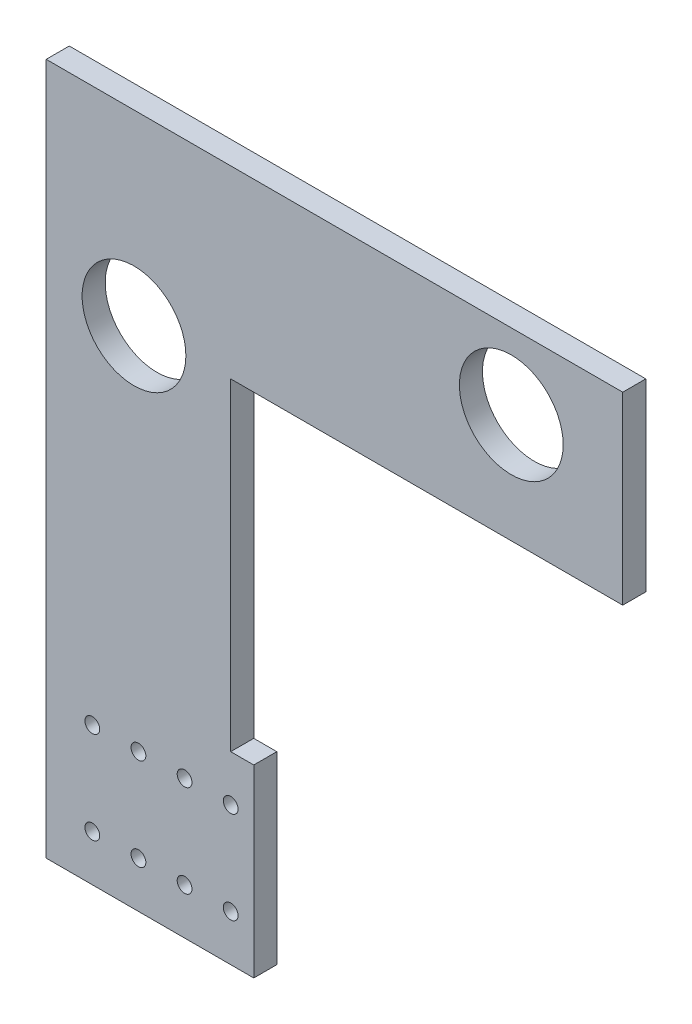
ISO-10303-21;
HEADER;
FILE_DESCRIPTION(('STEP AP214'),'2;1');
FILE_NAME('part.step','',(''),(''),'','','');
FILE_SCHEMA(('AUTOMOTIVE_DESIGN { 1 0 10303 214 1 1 1 1 }'));
ENDSEC;
DATA;
#1=APPLICATION_CONTEXT('core data for automotive mechanical design processes');
#2=APPLICATION_PROTOCOL_DEFINITION('international standard','automotive_design',2000,#1);
#3=PRODUCT_CONTEXT('',#1,'mechanical');
#4=PRODUCT('Part','Part','',(#3));
#5=PRODUCT_RELATED_PRODUCT_CATEGORY('part','',(#4));
#6=PRODUCT_DEFINITION_FORMATION('','',#4);
#7=PRODUCT_DEFINITION_CONTEXT('part definition',#1,'design');
#8=PRODUCT_DEFINITION('design','',#6,#7);
#9=PRODUCT_DEFINITION_SHAPE('','',#8);
#10=(LENGTH_UNIT() NAMED_UNIT(*) SI_UNIT(.MILLI.,.METRE.));
#11=(NAMED_UNIT(*) PLANE_ANGLE_UNIT() SI_UNIT($,.RADIAN.));
#12=(NAMED_UNIT(*) SI_UNIT($,.STERADIAN.) SOLID_ANGLE_UNIT());
#13=UNCERTAINTY_MEASURE_WITH_UNIT(LENGTH_MEASURE(1.E-05),#10,'distance_accuracy_value','');
#14=(GEOMETRIC_REPRESENTATION_CONTEXT(3) GLOBAL_UNCERTAINTY_ASSIGNED_CONTEXT((#13)) GLOBAL_UNIT_ASSIGNED_CONTEXT((#10,
#11,#12)) REPRESENTATION_CONTEXT('',''));
#15=CARTESIAN_POINT('',(0.,0.,0.));
#16=DIRECTION('',(0.,0.,1.));
#17=DIRECTION('',(1.,0.,0.));
#18=AXIS2_PLACEMENT_3D('',#15,#16,#17);
#19=CARTESIAN_POINT('',(-74.9920312203596,-159.641560720638,6.35));
#20=DIRECTION('',(0.,1.,0.));
#21=DIRECTION('',(0.,0.,1.));
#22=AXIS2_PLACEMENT_3D('',#19,#20,#21);
#23=PLANE('',#22);
#24=DIRECTION('',(1.,0.,0.));
#25=VECTOR('',#24,1.);
#26=CARTESIAN_POINT('',(-74.9920312203596,-159.641560720638,0.));
#27=LINE('',#26,#25);
#28=CARTESIAN_POINT('',(-125.79203122036,-159.641560720638,0.));
#29=VERTEX_POINT('',#28);
#30=CARTESIAN_POINT('',(-68.6420312203597,-159.641560720638,0.));
#31=VERTEX_POINT('',#30);
#32=EDGE_CURVE('E134',#29,#31,#27,.T.);
#33=ORIENTED_EDGE('',*,*,#32,.T.);
#34=DIRECTION('',(0.,0.,-1.));
#35=VECTOR('',#34,1.);
#36=CARTESIAN_POINT('',(-68.6420312203597,-159.641560720638,6.35));
#37=LINE('',#36,#35);
#38=CARTESIAN_POINT('',(-68.6420312203597,-159.641560720638,6.35));
#39=VERTEX_POINT('',#38);
#40=EDGE_CURVE('E42',#39,#31,#37,.T.);
#41=ORIENTED_EDGE('',*,*,#40,.F.);
#42=DIRECTION('',(1.,0.,0.));
#43=VECTOR('',#42,1.);
#44=CARTESIAN_POINT('',(-125.79203122036,-159.641560720638,6.35));
#45=LINE('',#44,#43);
#46=CARTESIAN_POINT('',(-125.79203122036,-159.641560720638,6.35));
#47=VERTEX_POINT('',#46);
#48=EDGE_CURVE('E94',#47,#39,#45,.T.);
#49=ORIENTED_EDGE('',*,*,#48,.F.);
#50=DIRECTION('',(0.,0.,-1.));
#51=VECTOR('',#50,1.);
#52=CARTESIAN_POINT('',(-125.79203122036,-159.641560720638,6.35));
#53=LINE('',#52,#51);
#54=EDGE_CURVE('E11',#47,#29,#53,.T.);
#55=ORIENTED_EDGE('',*,*,#54,.T.);
#56=EDGE_LOOP('',(#33,#41,#49,#55));
#57=FACE_BOUND('',#56,.T.);
#58=ADVANCED_FACE('F34',(#57),#23,.F.);
#59=CARTESIAN_POINT('',(-68.6420312203597,-159.641560720638,6.35));
#60=DIRECTION('',(-1.,0.,0.));
#61=DIRECTION('',(0.,0.,1.));
#62=AXIS2_PLACEMENT_3D('',#59,#60,#61);
#63=PLANE('',#62);
#64=DIRECTION('',(0.,1.,0.));
#65=VECTOR('',#64,1.);
#66=CARTESIAN_POINT('',(-68.6420312203597,-159.641560720638,0.));
#67=LINE('',#66,#65);
#68=CARTESIAN_POINT('',(-68.6420312203597,-108.841560720638,0.));
#69=VERTEX_POINT('',#68);
#70=EDGE_CURVE('E136',#31,#69,#67,.T.);
#71=ORIENTED_EDGE('',*,*,#70,.T.);
#72=DIRECTION('',(0.,0.,-1.));
#73=VECTOR('',#72,1.);
#74=CARTESIAN_POINT('',(-68.6420312203597,-108.841560720638,6.35));
#75=LINE('',#74,#73);
#76=CARTESIAN_POINT('',(-68.6420312203597,-108.841560720638,6.35));
#77=VERTEX_POINT('',#76);
#78=EDGE_CURVE('E155',#77,#69,#75,.T.);
#79=ORIENTED_EDGE('',*,*,#78,.F.);
#80=DIRECTION('',(0.,1.,0.));
#81=VECTOR('',#80,1.);
#82=CARTESIAN_POINT('',(-68.6420312203597,-159.641560720638,6.35));
#83=LINE('',#82,#81);
#84=EDGE_CURVE('E163',#39,#77,#83,.T.);
#85=ORIENTED_EDGE('',*,*,#84,.F.);
#86=ORIENTED_EDGE('',*,*,#40,.T.);
#87=EDGE_LOOP('',(#71,#79,#85,#86));
#88=FACE_BOUND('',#87,.T.);
#89=ADVANCED_FACE('F161',(#88),#63,.F.);
#90=CARTESIAN_POINT('',(-68.6420312203597,-108.841560720638,6.35));
#91=DIRECTION('',(0.,-1.,0.));
#92=DIRECTION('',(0.,0.,-1.));
#93=AXIS2_PLACEMENT_3D('',#90,#91,#92);
#94=PLANE('',#93);
#95=DIRECTION('',(-1.,0.,0.));
#96=VECTOR('',#95,1.);
#97=CARTESIAN_POINT('',(-68.6420312203597,-108.841560720638,0.));
#98=LINE('',#97,#96);
#99=CARTESIAN_POINT('',(-74.9920312203596,-108.841560720638,0.));
#100=VERTEX_POINT('',#99);
#101=EDGE_CURVE('E139',#69,#100,#98,.T.);
#102=ORIENTED_EDGE('',*,*,#101,.T.);
#103=DIRECTION('',(0.,0.,-1.));
#104=VECTOR('',#103,1.);
#105=CARTESIAN_POINT('',(-74.9920312203596,-108.841560720638,6.35));
#106=LINE('',#105,#104);
#107=CARTESIAN_POINT('',(-74.9920312203596,-108.841560720638,6.35));
#108=VERTEX_POINT('',#107);
#109=EDGE_CURVE('E152',#108,#100,#106,.T.);
#110=ORIENTED_EDGE('',*,*,#109,.F.);
#111=DIRECTION('',(-1.,0.,0.));
#112=VECTOR('',#111,1.);
#113=CARTESIAN_POINT('',(-68.6420312203597,-108.841560720638,6.35));
#114=LINE('',#113,#112);
#115=EDGE_CURVE('E175',#77,#108,#114,.T.);
#116=ORIENTED_EDGE('',*,*,#115,.F.);
#117=ORIENTED_EDGE('',*,*,#78,.T.);
#118=EDGE_LOOP('',(#102,#110,#116,#117));
#119=FACE_BOUND('',#118,.T.);
#120=ADVANCED_FACE('F171',(#119),#94,.F.);
#121=CARTESIAN_POINT('',(-74.9920312203596,-19.9415607206385,6.35));
#122=DIRECTION('',(-1.,0.,0.));
#123=DIRECTION('',(0.,0.,1.));
#124=AXIS2_PLACEMENT_3D('',#121,#122,#123);
#125=PLANE('',#124);
#126=DIRECTION('',(0.,1.,0.));
#127=VECTOR('',#126,1.);
#128=CARTESIAN_POINT('',(-74.9920312203596,-19.9415607206385,0.));
#129=LINE('',#128,#127);
#130=CARTESIAN_POINT('',(-74.9920312203596,-19.9415607206385,0.));
#131=VERTEX_POINT('',#130);
#132=EDGE_CURVE('E141',#100,#131,#129,.T.);
#133=ORIENTED_EDGE('',*,*,#132,.T.);
#134=DIRECTION('',(0.,0.,-1.));
#135=VECTOR('',#134,1.);
#136=CARTESIAN_POINT('',(-74.9920312203596,-19.9415607206385,6.35));
#137=LINE('',#136,#135);
#138=CARTESIAN_POINT('',(-74.9920312203596,-19.9415607206385,6.35));
#139=VERTEX_POINT('',#138);
#140=EDGE_CURVE('E123',#139,#131,#137,.T.);
#141=ORIENTED_EDGE('',*,*,#140,.F.);
#142=DIRECTION('',(0.,1.,0.));
#143=VECTOR('',#142,1.);
#144=CARTESIAN_POINT('',(-74.9920312203596,-19.9415607206385,6.35));
#145=LINE('',#144,#143);
#146=EDGE_CURVE('E114',#108,#139,#145,.T.);
#147=ORIENTED_EDGE('',*,*,#146,.F.);
#148=ORIENTED_EDGE('',*,*,#109,.T.);
#149=EDGE_LOOP('',(#133,#141,#147,#148));
#150=FACE_BOUND('',#149,.T.);
#151=ADVANCED_FACE('F174',(#150),#125,.F.);
#152=CARTESIAN_POINT('',(-74.9920312203596,-19.9415607206385,6.35));
#153=DIRECTION('',(0.,1.,0.));
#154=DIRECTION('',(0.,0.,1.));
#155=AXIS2_PLACEMENT_3D('',#152,#153,#154);
#156=PLANE('',#155);
#157=DIRECTION('',(1.,0.,0.));
#158=VECTOR('',#157,1.);
#159=CARTESIAN_POINT('',(-74.9920312203596,-19.9415607206385,0.));
#160=LINE('',#159,#158);
#161=CARTESIAN_POINT('',(32.9579687796403,-19.9415607206385,0.));
#162=VERTEX_POINT('',#161);
#163=EDGE_CURVE('E122',#131,#162,#160,.T.);
#164=ORIENTED_EDGE('',*,*,#163,.T.);
#165=DIRECTION('',(0.,0.,-1.));
#166=VECTOR('',#165,1.);
#167=CARTESIAN_POINT('',(32.9579687796403,-19.9415607206385,6.35));
#168=LINE('',#167,#166);
#169=CARTESIAN_POINT('',(32.9579687796403,-19.9415607206385,6.35));
#170=VERTEX_POINT('',#169);
#171=EDGE_CURVE('E119',#170,#162,#168,.T.);
#172=ORIENTED_EDGE('',*,*,#171,.F.);
#173=DIRECTION('',(1.,0.,0.));
#174=VECTOR('',#173,1.);
#175=CARTESIAN_POINT('',(-74.9920312203596,-19.9415607206385,6.35));
#176=LINE('',#175,#174);
#177=EDGE_CURVE('E108',#139,#170,#176,.T.);
#178=ORIENTED_EDGE('',*,*,#177,.F.);
#179=ORIENTED_EDGE('',*,*,#140,.T.);
#180=EDGE_LOOP('',(#164,#172,#178,#179));
#181=FACE_BOUND('',#180,.T.);
#182=ADVANCED_FACE('F120',(#181),#156,.F.);
#183=CARTESIAN_POINT('',(32.9579687796403,-19.9415607206385,6.35));
#184=DIRECTION('',(-1.,0.,0.));
#185=DIRECTION('',(0.,0.,1.));
#186=AXIS2_PLACEMENT_3D('',#183,#184,#185);
#187=PLANE('',#186);
#188=DIRECTION('',(0.,1.,0.));
#189=VECTOR('',#188,1.);
#190=CARTESIAN_POINT('',(32.9579687796403,-19.9415607206385,0.));
#191=LINE('',#190,#189);
#192=CARTESIAN_POINT('',(32.9579687796403,30.8584392793615,0.));
#193=VERTEX_POINT('',#192);
#194=EDGE_CURVE('E80',#162,#193,#191,.T.);
#195=ORIENTED_EDGE('',*,*,#194,.T.);
#196=DIRECTION('',(0.,0.,-1.));
#197=VECTOR('',#196,1.);
#198=CARTESIAN_POINT('',(32.9579687796403,30.8584392793615,6.35));
#199=LINE('',#198,#197);
#200=CARTESIAN_POINT('',(32.9579687796403,30.8584392793615,6.35));
#201=VERTEX_POINT('',#200);
#202=EDGE_CURVE('E124',#201,#193,#199,.T.);
#203=ORIENTED_EDGE('',*,*,#202,.F.);
#204=DIRECTION('',(0.,1.,0.));
#205=VECTOR('',#204,1.);
#206=CARTESIAN_POINT('',(32.9579687796403,-19.9415607206385,6.35));
#207=LINE('',#206,#205);
#208=EDGE_CURVE('E112',#170,#201,#207,.T.);
#209=ORIENTED_EDGE('',*,*,#208,.F.);
#210=ORIENTED_EDGE('',*,*,#171,.T.);
#211=EDGE_LOOP('',(#195,#203,#209,#210));
#212=FACE_BOUND('',#211,.T.);
#213=ADVANCED_FACE('F126',(#212),#187,.F.);
#214=CARTESIAN_POINT('',(32.9579687796403,30.8584392793615,6.35));
#215=DIRECTION('',(0.,-1.,0.));
#216=DIRECTION('',(0.,0.,-1.));
#217=AXIS2_PLACEMENT_3D('',#214,#215,#216);
#218=PLANE('',#217);
#219=DIRECTION('',(-1.,0.,0.));
#220=VECTOR('',#219,1.);
#221=CARTESIAN_POINT('',(32.9579687796403,30.8584392793615,0.));
#222=LINE('',#221,#220);
#223=CARTESIAN_POINT('',(-125.79203122036,30.8584392793615,0.));
#224=VERTEX_POINT('',#223);
#225=EDGE_CURVE('E87',#193,#224,#222,.T.);
#226=ORIENTED_EDGE('',*,*,#225,.T.);
#227=DIRECTION('',(0.,0.,-1.));
#228=VECTOR('',#227,1.);
#229=CARTESIAN_POINT('',(-125.79203122036,30.8584392793615,6.35));
#230=LINE('',#229,#228);
#231=CARTESIAN_POINT('',(-125.79203122036,30.8584392793615,6.35));
#232=VERTEX_POINT('',#231);
#233=EDGE_CURVE('E130',#232,#224,#230,.T.);
#234=ORIENTED_EDGE('',*,*,#233,.F.);
#235=DIRECTION('',(-1.,0.,0.));
#236=VECTOR('',#235,1.);
#237=CARTESIAN_POINT('',(32.9579687796403,30.8584392793615,6.35));
#238=LINE('',#237,#236);
#239=EDGE_CURVE('E128',#201,#232,#238,.T.);
#240=ORIENTED_EDGE('',*,*,#239,.F.);
#241=ORIENTED_EDGE('',*,*,#202,.T.);
#242=EDGE_LOOP('',(#226,#234,#240,#241));
#243=FACE_BOUND('',#242,.T.);
#244=ADVANCED_FACE('F272',(#243),#218,.F.);
#245=CARTESIAN_POINT('',(-125.79203122036,30.8584392793615,6.35));
#246=DIRECTION('',(1.,0.,0.));
#247=DIRECTION('',(0.,0.,-1.));
#248=AXIS2_PLACEMENT_3D('',#245,#246,#247);
#249=PLANE('',#248);
#250=DIRECTION('',(0.,-1.,0.));
#251=VECTOR('',#250,1.);
#252=CARTESIAN_POINT('',(-125.79203122036,30.8584392793615,0.));
#253=LINE('',#252,#251);
#254=EDGE_CURVE('E146',#224,#29,#253,.T.);
#255=ORIENTED_EDGE('',*,*,#254,.T.);
#256=ORIENTED_EDGE('',*,*,#54,.F.);
#257=DIRECTION('',(0.,-1.,0.));
#258=VECTOR('',#257,1.);
#259=CARTESIAN_POINT('',(-125.79203122036,-140.591560720638,6.35));
#260=LINE('',#259,#258);
#261=EDGE_CURVE('E50',#232,#47,#260,.T.);
#262=ORIENTED_EDGE('',*,*,#261,.F.);
#263=ORIENTED_EDGE('',*,*,#233,.T.);
#264=EDGE_LOOP('',(#255,#256,#262,#263));
#265=FACE_BOUND('',#264,.T.);
#266=ADVANCED_FACE('F253',(#265),#249,.F.);
#267=CARTESIAN_POINT('',(0.,0.,6.35));
#268=DIRECTION('',(0.,0.,1.));
#269=DIRECTION('',(1.,0.,0.));
#270=AXIS2_PLACEMENT_3D('',#267,#268,#269);
#271=PLANE('',#270);
#272=CARTESIAN_POINT('',(-87.6920312203597,-121.541560720638,6.35));
#273=DIRECTION('',(0.,0.,1.));
#274=DIRECTION('',(1.,0.,0.));
#275=AXIS2_PLACEMENT_3D('',#272,#273,#274);
#276=CIRCLE('',#275,2.03200000000001);
#277=CARTESIAN_POINT('',(-85.6600312203596,-121.541560720638,6.35));
#278=VERTEX_POINT('',#277);
#279=EDGE_CURVE('E218',#278,#278,#276,.T.);
#280=ORIENTED_EDGE('',*,*,#279,.F.);
#281=EDGE_LOOP('',(#280));
#282=FACE_BOUND('',#281,.T.);
#283=CARTESIAN_POINT('',(-113.09203122036,-146.941560720639,6.35));
#284=DIRECTION('',(0.,0.,1.));
#285=DIRECTION('',(1.,0.,0.));
#286=AXIS2_PLACEMENT_3D('',#283,#284,#285);
#287=CIRCLE('',#286,2.032);
#288=CARTESIAN_POINT('',(-111.06003122036,-146.941560720639,6.35));
#289=VERTEX_POINT('',#288);
#290=EDGE_CURVE('E211',#289,#289,#287,.T.);
#291=ORIENTED_EDGE('',*,*,#290,.F.);
#292=EDGE_LOOP('',(#291));
#293=FACE_BOUND('',#292,.T.);
#294=CARTESIAN_POINT('',(-100.39203122036,-146.941560720639,6.35));
#295=DIRECTION('',(0.,0.,1.));
#296=DIRECTION('',(1.,0.,0.));
#297=AXIS2_PLACEMENT_3D('',#294,#295,#296);
#298=CIRCLE('',#297,2.032);
#299=CARTESIAN_POINT('',(-98.3600312203596,-146.941560720639,6.35));
#300=VERTEX_POINT('',#299);
#301=EDGE_CURVE('E230',#300,#300,#298,.T.);
#302=ORIENTED_EDGE('',*,*,#301,.F.);
#303=EDGE_LOOP('',(#302));
#304=FACE_BOUND('',#303,.T.);
#305=CARTESIAN_POINT('',(-74.9920312203596,-121.541560720638,6.35));
#306=DIRECTION('',(0.,0.,1.));
#307=DIRECTION('',(1.,0.,0.));
#308=AXIS2_PLACEMENT_3D('',#305,#306,#307);
#309=CIRCLE('',#308,2.03200000000001);
#310=CARTESIAN_POINT('',(-72.9600312203596,-121.541560720638,6.35));
#311=VERTEX_POINT('',#310);
#312=EDGE_CURVE('E223',#311,#311,#309,.T.);
#313=ORIENTED_EDGE('',*,*,#312,.F.);
#314=EDGE_LOOP('',(#313));
#315=FACE_BOUND('',#314,.T.);
#316=CARTESIAN_POINT('',(-87.6920312203597,-146.941560720639,6.35));
#317=DIRECTION('',(0.,0.,1.));
#318=DIRECTION('',(1.,0.,0.));
#319=AXIS2_PLACEMENT_3D('',#316,#317,#318);
#320=CIRCLE('',#319,2.032);
#321=CARTESIAN_POINT('',(-85.6600312203596,-146.941560720639,6.35));
#322=VERTEX_POINT('',#321);
#323=EDGE_CURVE('E187',#322,#322,#320,.T.);
#324=ORIENTED_EDGE('',*,*,#323,.F.);
#325=EDGE_LOOP('',(#324));
#326=FACE_BOUND('',#325,.T.);
#327=CARTESIAN_POINT('',(-113.09203122036,-121.541560720638,6.35));
#328=DIRECTION('',(0.,0.,1.));
#329=DIRECTION('',(1.,0.,0.));
#330=AXIS2_PLACEMENT_3D('',#327,#328,#329);
#331=CIRCLE('',#330,2.03200000000001);
#332=CARTESIAN_POINT('',(-111.06003122036,-121.541560720638,6.35));
#333=VERTEX_POINT('',#332);
#334=EDGE_CURVE('E194',#333,#333,#331,.T.);
#335=ORIENTED_EDGE('',*,*,#334,.F.);
#336=EDGE_LOOP('',(#335));
#337=FACE_BOUND('',#336,.T.);
#338=CARTESIAN_POINT('',(-74.9920312203596,-146.941560720639,6.35));
#339=DIRECTION('',(0.,0.,1.));
#340=DIRECTION('',(1.,0.,0.));
#341=AXIS2_PLACEMENT_3D('',#338,#339,#340);
#342=CIRCLE('',#341,2.032);
#343=CARTESIAN_POINT('',(-72.9600312203596,-146.941560720639,6.35));
#344=VERTEX_POINT('',#343);
#345=EDGE_CURVE('E200',#344,#344,#342,.T.);
#346=ORIENTED_EDGE('',*,*,#345,.F.);
#347=EDGE_LOOP('',(#346));
#348=FACE_BOUND('',#347,.T.);
#349=CARTESIAN_POINT('',(2.2668849142445,10.1218360725294,6.35));
#350=DIRECTION('',(0.,0.,1.));
#351=DIRECTION('',(1.,0.,0.));
#352=AXIS2_PLACEMENT_3D('',#349,#350,#351);
#353=CIRCLE('',#352,14.2875);
#354=CARTESIAN_POINT('',(16.5543849142445,10.1218360725294,6.35));
#355=VERTEX_POINT('',#354);
#356=EDGE_CURVE('E206',#355,#355,#353,.T.);
#357=ORIENTED_EDGE('',*,*,#356,.F.);
#358=EDGE_LOOP('',(#357));
#359=FACE_BOUND('',#358,.T.);
#360=CARTESIAN_POINT('',(-100.39203122036,-121.541560720638,6.35));
#361=DIRECTION('',(0.,0.,1.));
#362=DIRECTION('',(1.,0.,0.));
#363=AXIS2_PLACEMENT_3D('',#360,#361,#362);
#364=CIRCLE('',#363,2.03200000000001);
#365=CARTESIAN_POINT('',(-98.3600312203596,-121.541560720638,6.35));
#366=VERTEX_POINT('',#365);
#367=EDGE_CURVE('E235',#366,#366,#364,.T.);
#368=ORIENTED_EDGE('',*,*,#367,.F.);
#369=EDGE_LOOP('',(#368));
#370=FACE_BOUND('',#369,.T.);
#371=CARTESIAN_POINT('',(-101.619115085755,-20.6121639274706,6.35));
#372=DIRECTION('',(0.,0.,1.));
#373=DIRECTION('',(1.,0.,0.));
#374=AXIS2_PLACEMENT_3D('',#371,#372,#373);
#375=CIRCLE('',#374,14.2875);
#376=CARTESIAN_POINT('',(-87.3316150857555,-20.6121639274706,6.35));
#377=VERTEX_POINT('',#376);
#378=EDGE_CURVE('E181',#377,#377,#375,.T.);
#379=ORIENTED_EDGE('',*,*,#378,.F.);
#380=EDGE_LOOP('',(#379));
#381=FACE_BOUND('',#380,.T.);
#382=ORIENTED_EDGE('',*,*,#261,.T.);
#383=ORIENTED_EDGE('',*,*,#48,.T.);
#384=ORIENTED_EDGE('',*,*,#84,.T.);
#385=ORIENTED_EDGE('',*,*,#115,.T.);
#386=ORIENTED_EDGE('',*,*,#146,.T.);
#387=ORIENTED_EDGE('',*,*,#177,.T.);
#388=ORIENTED_EDGE('',*,*,#208,.T.);
#389=ORIENTED_EDGE('',*,*,#239,.T.);
#390=EDGE_LOOP('',(#382,#383,#384,#385,#386,#387,#388,#389));
#391=FACE_BOUND('',#390,.T.);
#392=ADVANCED_FACE('F110',(#282,#293,#304,#315,#326,#337,#348,#359,#370,#381,#391),#271,.T.);
#393=CARTESIAN_POINT('',(0.,0.,0.));
#394=DIRECTION('',(0.,0.,1.));
#395=DIRECTION('',(1.,0.,0.));
#396=AXIS2_PLACEMENT_3D('',#393,#394,#395);
#397=PLANE('',#396);
#398=CARTESIAN_POINT('',(-87.6920312203597,-121.541560720638,0.));
#399=DIRECTION('',(0.,0.,1.));
#400=DIRECTION('',(1.,0.,0.));
#401=AXIS2_PLACEMENT_3D('',#398,#399,#400);
#402=CIRCLE('',#401,2.03200000000001);
#403=CARTESIAN_POINT('',(-85.6600312203596,-121.541560720638,0.));
#404=VERTEX_POINT('',#403);
#405=EDGE_CURVE('E191',#404,#404,#402,.T.);
#406=ORIENTED_EDGE('',*,*,#405,.T.);
#407=EDGE_LOOP('',(#406));
#408=FACE_BOUND('',#407,.T.);
#409=CARTESIAN_POINT('',(-113.09203122036,-146.941560720639,0.));
#410=DIRECTION('',(0.,0.,1.));
#411=DIRECTION('',(1.,0.,0.));
#412=AXIS2_PLACEMENT_3D('',#409,#410,#411);
#413=CIRCLE('',#412,2.032);
#414=CARTESIAN_POINT('',(-111.06003122036,-146.941560720639,0.));
#415=VERTEX_POINT('',#414);
#416=EDGE_CURVE('E214',#415,#415,#413,.T.);
#417=ORIENTED_EDGE('',*,*,#416,.T.);
#418=EDGE_LOOP('',(#417));
#419=FACE_BOUND('',#418,.T.);
#420=CARTESIAN_POINT('',(-100.39203122036,-146.941560720639,0.));
#421=DIRECTION('',(0.,0.,1.));
#422=DIRECTION('',(1.,0.,0.));
#423=AXIS2_PLACEMENT_3D('',#420,#421,#422);
#424=CIRCLE('',#423,2.032);
#425=CARTESIAN_POINT('',(-98.3600312203596,-146.941560720639,0.));
#426=VERTEX_POINT('',#425);
#427=EDGE_CURVE('E215',#426,#426,#424,.T.);
#428=ORIENTED_EDGE('',*,*,#427,.T.);
#429=EDGE_LOOP('',(#428));
#430=FACE_BOUND('',#429,.T.);
#431=CARTESIAN_POINT('',(-74.9920312203596,-121.541560720638,0.));
#432=DIRECTION('',(0.,0.,1.));
#433=DIRECTION('',(1.,0.,0.));
#434=AXIS2_PLACEMENT_3D('',#431,#432,#433);
#435=CIRCLE('',#434,2.03200000000001);
#436=CARTESIAN_POINT('',(-72.9600312203596,-121.541560720638,0.));
#437=VERTEX_POINT('',#436);
#438=EDGE_CURVE('E226',#437,#437,#435,.T.);
#439=ORIENTED_EDGE('',*,*,#438,.T.);
#440=EDGE_LOOP('',(#439));
#441=FACE_BOUND('',#440,.T.);
#442=CARTESIAN_POINT('',(-87.6920312203597,-146.941560720639,0.));
#443=DIRECTION('',(0.,0.,1.));
#444=DIRECTION('',(1.,0.,0.));
#445=AXIS2_PLACEMENT_3D('',#442,#443,#444);
#446=CIRCLE('',#445,2.032);
#447=CARTESIAN_POINT('',(-85.6600312203596,-146.941560720639,0.));
#448=VERTEX_POINT('',#447);
#449=EDGE_CURVE('E190',#448,#448,#446,.T.);
#450=ORIENTED_EDGE('',*,*,#449,.T.);
#451=EDGE_LOOP('',(#450));
#452=FACE_BOUND('',#451,.T.);
#453=CARTESIAN_POINT('',(-113.09203122036,-121.541560720638,0.));
#454=DIRECTION('',(0.,0.,1.));
#455=DIRECTION('',(1.,0.,0.));
#456=AXIS2_PLACEMENT_3D('',#453,#454,#455);
#457=CIRCLE('',#456,2.03200000000001);
#458=CARTESIAN_POINT('',(-111.06003122036,-121.541560720638,0.));
#459=VERTEX_POINT('',#458);
#460=EDGE_CURVE('E197',#459,#459,#457,.T.);
#461=ORIENTED_EDGE('',*,*,#460,.T.);
#462=EDGE_LOOP('',(#461));
#463=FACE_BOUND('',#462,.T.);
#464=CARTESIAN_POINT('',(-74.9920312203596,-146.941560720639,0.));
#465=DIRECTION('',(0.,0.,1.));
#466=DIRECTION('',(1.,0.,0.));
#467=AXIS2_PLACEMENT_3D('',#464,#465,#466);
#468=CIRCLE('',#467,2.032);
#469=CARTESIAN_POINT('',(-72.9600312203596,-146.941560720639,0.));
#470=VERTEX_POINT('',#469);
#471=EDGE_CURVE('E203',#470,#470,#468,.T.);
#472=ORIENTED_EDGE('',*,*,#471,.T.);
#473=EDGE_LOOP('',(#472));
#474=FACE_BOUND('',#473,.T.);
#475=CARTESIAN_POINT('',(2.2668849142445,10.1218360725294,0.));
#476=DIRECTION('',(0.,0.,1.));
#477=DIRECTION('',(1.,0.,0.));
#478=AXIS2_PLACEMENT_3D('',#475,#476,#477);
#479=CIRCLE('',#478,14.2875);
#480=CARTESIAN_POINT('',(16.5543849142445,10.1218360725294,0.));
#481=VERTEX_POINT('',#480);
#482=EDGE_CURVE('E184',#481,#481,#479,.T.);
#483=ORIENTED_EDGE('',*,*,#482,.T.);
#484=EDGE_LOOP('',(#483));
#485=FACE_BOUND('',#484,.T.);
#486=CARTESIAN_POINT('',(-100.39203122036,-121.541560720638,0.));
#487=DIRECTION('',(0.,0.,1.));
#488=DIRECTION('',(1.,0.,0.));
#489=AXIS2_PLACEMENT_3D('',#486,#487,#488);
#490=CIRCLE('',#489,2.03200000000001);
#491=CARTESIAN_POINT('',(-98.3600312203596,-121.541560720638,0.));
#492=VERTEX_POINT('',#491);
#493=EDGE_CURVE('E227',#492,#492,#490,.T.);
#494=ORIENTED_EDGE('',*,*,#493,.T.);
#495=EDGE_LOOP('',(#494));
#496=FACE_BOUND('',#495,.T.);
#497=CARTESIAN_POINT('',(-101.619115085755,-20.6121639274706,0.));
#498=DIRECTION('',(0.,0.,1.));
#499=DIRECTION('',(1.,0.,0.));
#500=AXIS2_PLACEMENT_3D('',#497,#498,#499);
#501=CIRCLE('',#500,14.2875);
#502=CARTESIAN_POINT('',(-87.3316150857555,-20.6121639274706,0.));
#503=VERTEX_POINT('',#502);
#504=EDGE_CURVE('E137',#503,#503,#501,.T.);
#505=ORIENTED_EDGE('',*,*,#504,.T.);
#506=EDGE_LOOP('',(#505));
#507=FACE_BOUND('',#506,.T.);
#508=ORIENTED_EDGE('',*,*,#32,.F.);
#509=ORIENTED_EDGE('',*,*,#254,.F.);
#510=ORIENTED_EDGE('',*,*,#225,.F.);
#511=ORIENTED_EDGE('',*,*,#194,.F.);
#512=ORIENTED_EDGE('',*,*,#163,.F.);
#513=ORIENTED_EDGE('',*,*,#132,.F.);
#514=ORIENTED_EDGE('',*,*,#101,.F.);
#515=ORIENTED_EDGE('',*,*,#70,.F.);
#516=EDGE_LOOP('',(#508,#509,#510,#511,#512,#513,#514,#515));
#517=FACE_BOUND('',#516,.T.);
#518=ADVANCED_FACE('F166',(#408,#419,#430,#441,#452,#463,#474,#485,#496,#507,#517),#397,.F.);
#519=CARTESIAN_POINT('',(-101.619115085755,-20.6121639274706,0.));
#520=DIRECTION('',(0.,0.,1.));
#521=DIRECTION('',(1.,0.,0.));
#522=AXIS2_PLACEMENT_3D('',#519,#520,#521);
#523=CYLINDRICAL_SURFACE('',#522,14.2875);
#524=ORIENTED_EDGE('',*,*,#504,.F.);
#525=EDGE_LOOP('',(#524));
#526=FACE_BOUND('',#525,.T.);
#527=ORIENTED_EDGE('',*,*,#378,.T.);
#528=EDGE_LOOP('',(#527));
#529=FACE_BOUND('',#528,.T.);
#530=ADVANCED_FACE('F247',(#526,#529),#523,.F.);
#531=CARTESIAN_POINT('',(-100.39203122036,-121.541560720638,0.));
#532=DIRECTION('',(0.,0.,1.));
#533=DIRECTION('',(1.,0.,0.));
#534=AXIS2_PLACEMENT_3D('',#531,#532,#533);
#535=CYLINDRICAL_SURFACE('',#534,2.03200000000001);
#536=ORIENTED_EDGE('',*,*,#493,.F.);
#537=EDGE_LOOP('',(#536));
#538=FACE_BOUND('',#537,.T.);
#539=ORIENTED_EDGE('',*,*,#367,.T.);
#540=EDGE_LOOP('',(#539));
#541=FACE_BOUND('',#540,.T.);
#542=ADVANCED_FACE('F243',(#538,#541),#535,.F.);
#543=CARTESIAN_POINT('',(2.2668849142445,10.1218360725294,0.));
#544=DIRECTION('',(0.,0.,1.));
#545=DIRECTION('',(1.,0.,0.));
#546=AXIS2_PLACEMENT_3D('',#543,#544,#545);
#547=CYLINDRICAL_SURFACE('',#546,14.2875);
#548=ORIENTED_EDGE('',*,*,#482,.F.);
#549=EDGE_LOOP('',(#548));
#550=FACE_BOUND('',#549,.T.);
#551=ORIENTED_EDGE('',*,*,#356,.T.);
#552=EDGE_LOOP('',(#551));
#553=FACE_BOUND('',#552,.T.);
#554=ADVANCED_FACE('F246',(#550,#553),#547,.F.);
#555=CARTESIAN_POINT('',(-74.9920312203596,-146.941560720639,0.));
#556=DIRECTION('',(0.,0.,1.));
#557=DIRECTION('',(1.,0.,0.));
#558=AXIS2_PLACEMENT_3D('',#555,#556,#557);
#559=CYLINDRICAL_SURFACE('',#558,2.032);
#560=ORIENTED_EDGE('',*,*,#471,.F.);
#561=EDGE_LOOP('',(#560));
#562=FACE_BOUND('',#561,.T.);
#563=ORIENTED_EDGE('',*,*,#345,.T.);
#564=EDGE_LOOP('',(#563));
#565=FACE_BOUND('',#564,.T.);
#566=ADVANCED_FACE('F345',(#562,#565),#559,.F.);
#567=CARTESIAN_POINT('',(-113.09203122036,-121.541560720638,0.));
#568=DIRECTION('',(0.,0.,1.));
#569=DIRECTION('',(1.,0.,0.));
#570=AXIS2_PLACEMENT_3D('',#567,#568,#569);
#571=CYLINDRICAL_SURFACE('',#570,2.03200000000001);
#572=ORIENTED_EDGE('',*,*,#460,.F.);
#573=EDGE_LOOP('',(#572));
#574=FACE_BOUND('',#573,.T.);
#575=ORIENTED_EDGE('',*,*,#334,.T.);
#576=EDGE_LOOP('',(#575));
#577=FACE_BOUND('',#576,.T.);
#578=ADVANCED_FACE('F355',(#574,#577),#571,.F.);
#579=CARTESIAN_POINT('',(-87.6920312203597,-146.941560720639,0.));
#580=DIRECTION('',(0.,0.,1.));
#581=DIRECTION('',(1.,0.,0.));
#582=AXIS2_PLACEMENT_3D('',#579,#580,#581);
#583=CYLINDRICAL_SURFACE('',#582,2.032);
#584=ORIENTED_EDGE('',*,*,#449,.F.);
#585=EDGE_LOOP('',(#584));
#586=FACE_BOUND('',#585,.T.);
#587=ORIENTED_EDGE('',*,*,#323,.T.);
#588=EDGE_LOOP('',(#587));
#589=FACE_BOUND('',#588,.T.);
#590=ADVANCED_FACE('F365',(#586,#589),#583,.F.);
#591=CARTESIAN_POINT('',(-74.9920312203596,-121.541560720638,0.));
#592=DIRECTION('',(0.,0.,1.));
#593=DIRECTION('',(1.,0.,0.));
#594=AXIS2_PLACEMENT_3D('',#591,#592,#593);
#595=CYLINDRICAL_SURFACE('',#594,2.03200000000001);
#596=ORIENTED_EDGE('',*,*,#438,.F.);
#597=EDGE_LOOP('',(#596));
#598=FACE_BOUND('',#597,.T.);
#599=ORIENTED_EDGE('',*,*,#312,.T.);
#600=EDGE_LOOP('',(#599));
#601=FACE_BOUND('',#600,.T.);
#602=ADVANCED_FACE('F375',(#598,#601),#595,.F.);
#603=CARTESIAN_POINT('',(-100.39203122036,-146.941560720639,0.));
#604=DIRECTION('',(0.,0.,1.));
#605=DIRECTION('',(1.,0.,0.));
#606=AXIS2_PLACEMENT_3D('',#603,#604,#605);
#607=CYLINDRICAL_SURFACE('',#606,2.032);
#608=ORIENTED_EDGE('',*,*,#427,.F.);
#609=EDGE_LOOP('',(#608));
#610=FACE_BOUND('',#609,.T.);
#611=ORIENTED_EDGE('',*,*,#301,.T.);
#612=EDGE_LOOP('',(#611));
#613=FACE_BOUND('',#612,.T.);
#614=ADVANCED_FACE('F384',(#610,#613),#607,.F.);
#615=CARTESIAN_POINT('',(-113.09203122036,-146.941560720639,0.));
#616=DIRECTION('',(0.,0.,1.));
#617=DIRECTION('',(1.,0.,0.));
#618=AXIS2_PLACEMENT_3D('',#615,#616,#617);
#619=CYLINDRICAL_SURFACE('',#618,2.032);
#620=ORIENTED_EDGE('',*,*,#416,.F.);
#621=EDGE_LOOP('',(#620));
#622=FACE_BOUND('',#621,.T.);
#623=ORIENTED_EDGE('',*,*,#290,.T.);
#624=EDGE_LOOP('',(#623));
#625=FACE_BOUND('',#624,.T.);
#626=ADVANCED_FACE('F394',(#622,#625),#619,.F.);
#627=CARTESIAN_POINT('',(-87.6920312203597,-121.541560720638,0.));
#628=DIRECTION('',(0.,0.,1.));
#629=DIRECTION('',(1.,0.,0.));
#630=AXIS2_PLACEMENT_3D('',#627,#628,#629);
#631=CYLINDRICAL_SURFACE('',#630,2.03200000000001);
#632=ORIENTED_EDGE('',*,*,#405,.F.);
#633=EDGE_LOOP('',(#632));
#634=FACE_BOUND('',#633,.T.);
#635=ORIENTED_EDGE('',*,*,#279,.T.);
#636=EDGE_LOOP('',(#635));
#637=FACE_BOUND('',#636,.T.);
#638=ADVANCED_FACE('F404',(#634,#637),#631,.F.);
#639=CLOSED_SHELL('',(#58,#89,#120,#151,#182,#213,#244,#266,#392,#518,#530,#542,#554,#566,#578,
#590,#602,#614,#626,#638));
#640=MANIFOLD_SOLID_BREP('B2',#639);
#641=ADVANCED_BREP_SHAPE_REPRESENTATION('',(#18,#640),#14);
#642=SHAPE_DEFINITION_REPRESENTATION(#9,#641);
ENDSEC;
END-ISO-10303-21;
